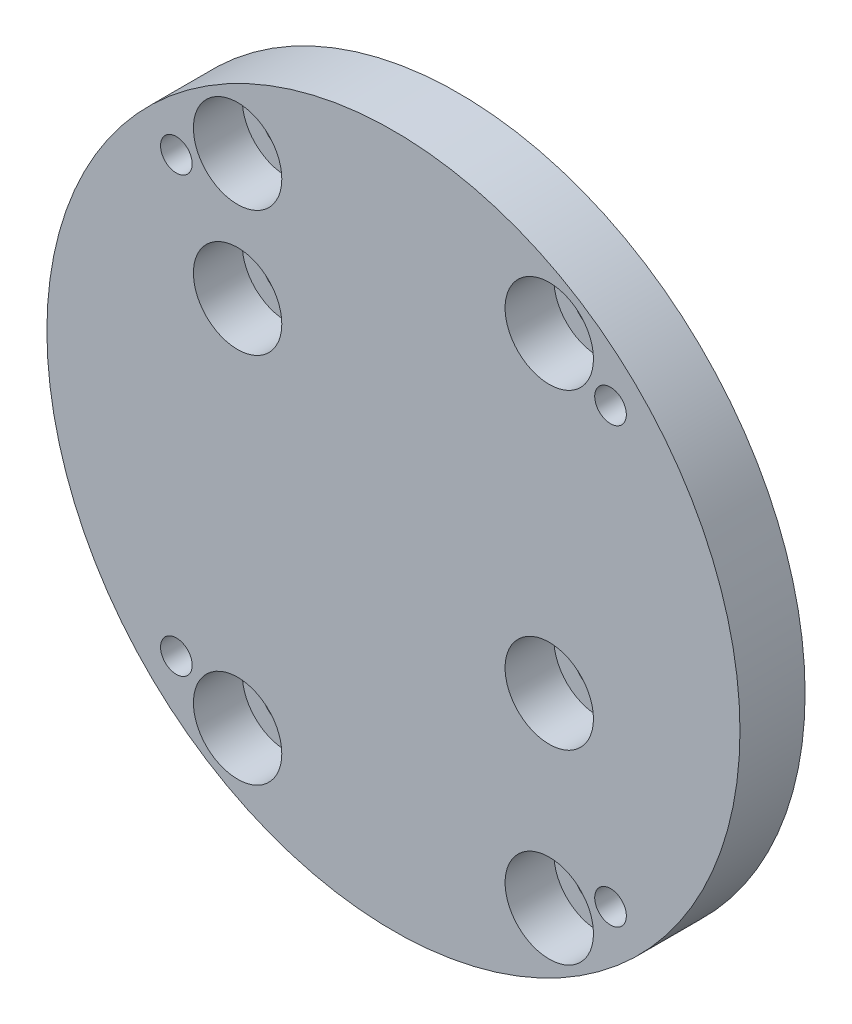
ISO-10303-21;
HEADER;
FILE_DESCRIPTION(('STEP AP214'),'2;1');
FILE_NAME('part.step','',(''),(''),'','','');
FILE_SCHEMA(('AUTOMOTIVE_DESIGN { 1 0 10303 214 1 1 1 1 }'));
ENDSEC;
DATA;
#1=APPLICATION_CONTEXT('core data for automotive mechanical design processes');
#2=APPLICATION_PROTOCOL_DEFINITION('international standard','automotive_design',2000,#1);
#3=PRODUCT_CONTEXT('',#1,'mechanical');
#4=PRODUCT('Part','Part','',(#3));
#5=PRODUCT_RELATED_PRODUCT_CATEGORY('part','',(#4));
#6=PRODUCT_DEFINITION_FORMATION('','',#4);
#7=PRODUCT_DEFINITION_CONTEXT('part definition',#1,'design');
#8=PRODUCT_DEFINITION('design','',#6,#7);
#9=PRODUCT_DEFINITION_SHAPE('','',#8);
#10=(LENGTH_UNIT() NAMED_UNIT(*) SI_UNIT(.MILLI.,.METRE.));
#11=(NAMED_UNIT(*) PLANE_ANGLE_UNIT() SI_UNIT($,.RADIAN.));
#12=(NAMED_UNIT(*) SI_UNIT($,.STERADIAN.) SOLID_ANGLE_UNIT());
#13=UNCERTAINTY_MEASURE_WITH_UNIT(LENGTH_MEASURE(1.E-05),#10,'distance_accuracy_value','');
#14=(GEOMETRIC_REPRESENTATION_CONTEXT(3) GLOBAL_UNCERTAINTY_ASSIGNED_CONTEXT((#13)) GLOBAL_UNIT_ASSIGNED_CONTEXT((#10,
#11,#12)) REPRESENTATION_CONTEXT('',''));
#15=CARTESIAN_POINT('',(0.,0.,0.));
#16=DIRECTION('',(0.,0.,1.));
#17=DIRECTION('',(1.,0.,0.));
#18=AXIS2_PLACEMENT_3D('',#15,#16,#17);
#19=CARTESIAN_POINT('',(0.,0.,14.));
#20=DIRECTION('',(0.,0.,-1.));
#21=DIRECTION('',(-1.,0.,0.));
#22=AXIS2_PLACEMENT_3D('',#19,#20,#21);
#23=CYLINDRICAL_SURFACE('',#22,74.5);
#24=CARTESIAN_POINT('',(0.,0.,14.));
#25=DIRECTION('',(0.,0.,1.));
#26=DIRECTION('',(1.,0.,0.));
#27=AXIS2_PLACEMENT_3D('',#24,#25,#26);
#28=CIRCLE('',#27,74.5);
#29=CARTESIAN_POINT('',(74.5,0.,14.));
#30=VERTEX_POINT('',#29);
#31=EDGE_CURVE('E10',#30,#30,#28,.T.);
#32=ORIENTED_EDGE('',*,*,#31,.F.);
#33=EDGE_LOOP('',(#32));
#34=FACE_BOUND('',#33,.T.);
#35=CARTESIAN_POINT('',(0.,0.,0.));
#36=DIRECTION('',(0.,0.,1.));
#37=DIRECTION('',(1.,0.,0.));
#38=AXIS2_PLACEMENT_3D('',#35,#36,#37);
#39=CIRCLE('',#38,74.5);
#40=CARTESIAN_POINT('',(74.5,0.,0.));
#41=VERTEX_POINT('',#40);
#42=EDGE_CURVE('E35',#41,#41,#39,.T.);
#43=ORIENTED_EDGE('',*,*,#42,.T.);
#44=EDGE_LOOP('',(#43));
#45=FACE_BOUND('',#44,.T.);
#46=ADVANCED_FACE('F32',(#34,#45),#23,.T.);
#47=CARTESIAN_POINT('',(0.,0.,14.));
#48=DIRECTION('',(0.,0.,1.));
#49=DIRECTION('',(1.,0.,0.));
#50=AXIS2_PLACEMENT_3D('',#47,#48,#49);
#51=PLANE('',#50);
#52=CARTESIAN_POINT('',(-46.6690475583116,46.6690475583127,14.));
#53=DIRECTION('',(0.,0.,1.));
#54=DIRECTION('',(1.,0.,0.));
#55=AXIS2_PLACEMENT_3D('',#52,#53,#54);
#56=CIRCLE('',#55,3.39999999999999);
#57=CARTESIAN_POINT('',(-43.2690475583116,46.6690475583127,14.));
#58=VERTEX_POINT('',#57);
#59=EDGE_CURVE('E136',#58,#58,#56,.T.);
#60=ORIENTED_EDGE('',*,*,#59,.F.);
#61=EDGE_LOOP('',(#60));
#62=FACE_BOUND('',#61,.T.);
#63=CARTESIAN_POINT('',(-46.6690475583122,-46.6690475583121,14.));
#64=DIRECTION('',(0.,0.,1.));
#65=DIRECTION('',(1.,0.,0.));
#66=AXIS2_PLACEMENT_3D('',#63,#64,#65);
#67=CIRCLE('',#66,3.39999999999999);
#68=CARTESIAN_POINT('',(-43.2690475583122,-46.6690475583121,14.));
#69=VERTEX_POINT('',#68);
#70=EDGE_CURVE('E130',#69,#69,#67,.T.);
#71=ORIENTED_EDGE('',*,*,#70,.F.);
#72=EDGE_LOOP('',(#71));
#73=FACE_BOUND('',#72,.T.);
#74=CARTESIAN_POINT('',(46.6690475583119,-46.6690475583124,14.));
#75=DIRECTION('',(0.,0.,1.));
#76=DIRECTION('',(1.,0.,0.));
#77=AXIS2_PLACEMENT_3D('',#74,#75,#76);
#78=CIRCLE('',#77,3.39999999999999);
#79=CARTESIAN_POINT('',(50.0690475583119,-46.6690475583124,14.));
#80=VERTEX_POINT('',#79);
#81=EDGE_CURVE('E124',#80,#80,#78,.T.);
#82=ORIENTED_EDGE('',*,*,#81,.F.);
#83=EDGE_LOOP('',(#82));
#84=FACE_BOUND('',#83,.T.);
#85=CARTESIAN_POINT('',(46.6690475583122,46.6690475583121,14.));
#86=DIRECTION('',(0.,0.,1.));
#87=DIRECTION('',(1.,0.,0.));
#88=AXIS2_PLACEMENT_3D('',#85,#86,#87);
#89=CIRCLE('',#88,3.39999999999999);
#90=CARTESIAN_POINT('',(50.0690475583122,46.6690475583121,14.));
#91=VERTEX_POINT('',#90);
#92=EDGE_CURVE('E118',#91,#91,#89,.T.);
#93=ORIENTED_EDGE('',*,*,#92,.F.);
#94=EDGE_LOOP('',(#93));
#95=FACE_BOUND('',#94,.T.);
#96=CARTESIAN_POINT('',(-33.5,26.5,14.));
#97=DIRECTION('',(0.,0.,1.));
#98=DIRECTION('',(1.,0.,0.));
#99=AXIS2_PLACEMENT_3D('',#96,#97,#98);
#100=CIRCLE('',#99,9.5);
#101=CARTESIAN_POINT('',(-24.,26.5,14.));
#102=VERTEX_POINT('',#101);
#103=EDGE_CURVE('E112',#102,#102,#100,.T.);
#104=ORIENTED_EDGE('',*,*,#103,.F.);
#105=EDGE_LOOP('',(#104));
#106=FACE_BOUND('',#105,.T.);
#107=CARTESIAN_POINT('',(-33.5,-53.5,14.));
#108=DIRECTION('',(0.,0.,1.));
#109=DIRECTION('',(1.,0.,0.));
#110=AXIS2_PLACEMENT_3D('',#107,#108,#109);
#111=CIRCLE('',#110,9.5);
#112=CARTESIAN_POINT('',(-24.,-53.5,14.));
#113=VERTEX_POINT('',#112);
#114=EDGE_CURVE('E100',#113,#113,#111,.T.);
#115=ORIENTED_EDGE('',*,*,#114,.F.);
#116=EDGE_LOOP('',(#115));
#117=FACE_BOUND('',#116,.T.);
#118=CARTESIAN_POINT('',(33.5,-53.5,14.));
#119=DIRECTION('',(0.,0.,1.));
#120=DIRECTION('',(1.,0.,0.));
#121=AXIS2_PLACEMENT_3D('',#118,#119,#120);
#122=CIRCLE('',#121,9.49999999999999);
#123=CARTESIAN_POINT('',(43.,-53.5,14.));
#124=VERTEX_POINT('',#123);
#125=EDGE_CURVE('E88',#124,#124,#122,.T.);
#126=ORIENTED_EDGE('',*,*,#125,.F.);
#127=EDGE_LOOP('',(#126));
#128=FACE_BOUND('',#127,.T.);
#129=CARTESIAN_POINT('',(33.5,-13.5,14.));
#130=DIRECTION('',(0.,0.,1.));
#131=DIRECTION('',(1.,0.,0.));
#132=AXIS2_PLACEMENT_3D('',#129,#130,#131);
#133=CIRCLE('',#132,9.49999999999999);
#134=CARTESIAN_POINT('',(43.,-13.5,14.));
#135=VERTEX_POINT('',#134);
#136=EDGE_CURVE('E76',#135,#135,#133,.T.);
#137=ORIENTED_EDGE('',*,*,#136,.F.);
#138=EDGE_LOOP('',(#137));
#139=FACE_BOUND('',#138,.T.);
#140=CARTESIAN_POINT('',(33.5,53.5,14.));
#141=DIRECTION('',(0.,0.,1.));
#142=DIRECTION('',(1.,0.,0.));
#143=AXIS2_PLACEMENT_3D('',#140,#141,#142);
#144=CIRCLE('',#143,9.49999999999999);
#145=CARTESIAN_POINT('',(43.,53.5,14.));
#146=VERTEX_POINT('',#145);
#147=EDGE_CURVE('E64',#146,#146,#144,.T.);
#148=ORIENTED_EDGE('',*,*,#147,.F.);
#149=EDGE_LOOP('',(#148));
#150=FACE_BOUND('',#149,.T.);
#151=CARTESIAN_POINT('',(-33.5,53.5,14.));
#152=DIRECTION('',(0.,0.,1.));
#153=DIRECTION('',(1.,0.,0.));
#154=AXIS2_PLACEMENT_3D('',#151,#152,#153);
#155=CIRCLE('',#154,9.5);
#156=CARTESIAN_POINT('',(-24.,53.5,14.));
#157=VERTEX_POINT('',#156);
#158=EDGE_CURVE('E52',#157,#157,#155,.T.);
#159=ORIENTED_EDGE('',*,*,#158,.F.);
#160=EDGE_LOOP('',(#159));
#161=FACE_BOUND('',#160,.T.);
#162=ORIENTED_EDGE('',*,*,#31,.T.);
#163=EDGE_LOOP('',(#162));
#164=FACE_BOUND('',#163,.T.);
#165=ADVANCED_FACE('F142',(#62,#73,#84,#95,#106,#117,#128,#139,#150,#161,#164),#51,.T.);
#166=CARTESIAN_POINT('',(0.,0.,0.));
#167=DIRECTION('',(0.,0.,1.));
#168=DIRECTION('',(1.,0.,0.));
#169=AXIS2_PLACEMENT_3D('',#166,#167,#168);
#170=PLANE('',#169);
#171=CARTESIAN_POINT('',(-46.6690475583116,46.6690475583127,0.));
#172=DIRECTION('',(0.,0.,1.));
#173=DIRECTION('',(1.,0.,0.));
#174=AXIS2_PLACEMENT_3D('',#171,#172,#173);
#175=CIRCLE('',#174,3.39999999999999);
#176=CARTESIAN_POINT('',(-43.2690475583116,46.6690475583127,0.));
#177=VERTEX_POINT('',#176);
#178=EDGE_CURVE('E133',#177,#177,#175,.T.);
#179=ORIENTED_EDGE('',*,*,#178,.T.);
#180=EDGE_LOOP('',(#179));
#181=FACE_BOUND('',#180,.T.);
#182=CARTESIAN_POINT('',(-46.6690475583122,-46.6690475583121,0.));
#183=DIRECTION('',(0.,0.,1.));
#184=DIRECTION('',(1.,0.,0.));
#185=AXIS2_PLACEMENT_3D('',#182,#183,#184);
#186=CIRCLE('',#185,3.39999999999999);
#187=CARTESIAN_POINT('',(-43.2690475583122,-46.6690475583121,0.));
#188=VERTEX_POINT('',#187);
#189=EDGE_CURVE('E127',#188,#188,#186,.T.);
#190=ORIENTED_EDGE('',*,*,#189,.T.);
#191=EDGE_LOOP('',(#190));
#192=FACE_BOUND('',#191,.T.);
#193=CARTESIAN_POINT('',(46.6690475583119,-46.6690475583124,0.));
#194=DIRECTION('',(0.,0.,1.));
#195=DIRECTION('',(1.,0.,0.));
#196=AXIS2_PLACEMENT_3D('',#193,#194,#195);
#197=CIRCLE('',#196,3.39999999999999);
#198=CARTESIAN_POINT('',(50.0690475583119,-46.6690475583124,0.));
#199=VERTEX_POINT('',#198);
#200=EDGE_CURVE('E121',#199,#199,#197,.T.);
#201=ORIENTED_EDGE('',*,*,#200,.T.);
#202=EDGE_LOOP('',(#201));
#203=FACE_BOUND('',#202,.T.);
#204=CARTESIAN_POINT('',(46.6690475583122,46.6690475583121,0.));
#205=DIRECTION('',(0.,0.,1.));
#206=DIRECTION('',(1.,0.,0.));
#207=AXIS2_PLACEMENT_3D('',#204,#205,#206);
#208=CIRCLE('',#207,3.39999999999999);
#209=CARTESIAN_POINT('',(50.0690475583122,46.6690475583121,0.));
#210=VERTEX_POINT('',#209);
#211=EDGE_CURVE('E115',#210,#210,#208,.T.);
#212=ORIENTED_EDGE('',*,*,#211,.T.);
#213=EDGE_LOOP('',(#212));
#214=FACE_BOUND('',#213,.T.);
#215=CARTESIAN_POINT('',(-33.5,26.5,0.));
#216=DIRECTION('',(0.,0.,1.));
#217=DIRECTION('',(1.,0.,0.));
#218=AXIS2_PLACEMENT_3D('',#215,#216,#217);
#219=CIRCLE('',#218,5.5);
#220=CARTESIAN_POINT('',(-28.,26.5,0.));
#221=VERTEX_POINT('',#220);
#222=EDGE_CURVE('E103',#221,#221,#219,.T.);
#223=ORIENTED_EDGE('',*,*,#222,.T.);
#224=EDGE_LOOP('',(#223));
#225=FACE_BOUND('',#224,.T.);
#226=CARTESIAN_POINT('',(-33.5,-53.5,0.));
#227=DIRECTION('',(0.,0.,1.));
#228=DIRECTION('',(1.,0.,0.));
#229=AXIS2_PLACEMENT_3D('',#226,#227,#228);
#230=CIRCLE('',#229,5.5);
#231=CARTESIAN_POINT('',(-28.,-53.5,0.));
#232=VERTEX_POINT('',#231);
#233=EDGE_CURVE('E91',#232,#232,#230,.T.);
#234=ORIENTED_EDGE('',*,*,#233,.T.);
#235=EDGE_LOOP('',(#234));
#236=FACE_BOUND('',#235,.T.);
#237=CARTESIAN_POINT('',(33.5,-53.5,0.));
#238=DIRECTION('',(0.,0.,1.));
#239=DIRECTION('',(1.,0.,0.));
#240=AXIS2_PLACEMENT_3D('',#237,#238,#239);
#241=CIRCLE('',#240,5.5);
#242=CARTESIAN_POINT('',(39.,-53.5,0.));
#243=VERTEX_POINT('',#242);
#244=EDGE_CURVE('E79',#243,#243,#241,.T.);
#245=ORIENTED_EDGE('',*,*,#244,.T.);
#246=EDGE_LOOP('',(#245));
#247=FACE_BOUND('',#246,.T.);
#248=CARTESIAN_POINT('',(33.5,-13.5,0.));
#249=DIRECTION('',(0.,0.,1.));
#250=DIRECTION('',(1.,0.,0.));
#251=AXIS2_PLACEMENT_3D('',#248,#249,#250);
#252=CIRCLE('',#251,5.5);
#253=CARTESIAN_POINT('',(39.,-13.5,0.));
#254=VERTEX_POINT('',#253);
#255=EDGE_CURVE('E67',#254,#254,#252,.T.);
#256=ORIENTED_EDGE('',*,*,#255,.T.);
#257=EDGE_LOOP('',(#256));
#258=FACE_BOUND('',#257,.T.);
#259=CARTESIAN_POINT('',(33.5,53.5,0.));
#260=DIRECTION('',(0.,0.,1.));
#261=DIRECTION('',(1.,0.,0.));
#262=AXIS2_PLACEMENT_3D('',#259,#260,#261);
#263=CIRCLE('',#262,5.5);
#264=CARTESIAN_POINT('',(39.,53.5,0.));
#265=VERTEX_POINT('',#264);
#266=EDGE_CURVE('E55',#265,#265,#263,.T.);
#267=ORIENTED_EDGE('',*,*,#266,.T.);
#268=EDGE_LOOP('',(#267));
#269=FACE_BOUND('',#268,.T.);
#270=CARTESIAN_POINT('',(-33.5,53.5,0.));
#271=DIRECTION('',(0.,0.,1.));
#272=DIRECTION('',(1.,0.,0.));
#273=AXIS2_PLACEMENT_3D('',#270,#271,#272);
#274=CIRCLE('',#273,5.5);
#275=CARTESIAN_POINT('',(-28.,53.5,0.));
#276=VERTEX_POINT('',#275);
#277=EDGE_CURVE('E42',#276,#276,#274,.T.);
#278=ORIENTED_EDGE('',*,*,#277,.T.);
#279=EDGE_LOOP('',(#278));
#280=FACE_BOUND('',#279,.T.);
#281=ORIENTED_EDGE('',*,*,#42,.F.);
#282=EDGE_LOOP('',(#281));
#283=FACE_BOUND('',#282,.T.);
#284=ADVANCED_FACE('F145',(#181,#192,#203,#214,#225,#236,#247,#258,#269,#280,#283),#170,.F.);
#285=CARTESIAN_POINT('',(-33.5,53.5,14.));
#286=DIRECTION('',(0.,0.,1.));
#287=DIRECTION('',(1.,0.,0.));
#288=AXIS2_PLACEMENT_3D('',#285,#286,#287);
#289=CYLINDRICAL_SURFACE('',#288,5.5);
#290=ORIENTED_EDGE('',*,*,#277,.F.);
#291=EDGE_LOOP('',(#290));
#292=FACE_BOUND('',#291,.T.);
#293=CARTESIAN_POINT('',(-33.5,53.5,3.5));
#294=DIRECTION('',(0.,0.,1.));
#295=DIRECTION('',(1.,0.,0.));
#296=AXIS2_PLACEMENT_3D('',#293,#294,#295);
#297=CIRCLE('',#296,5.5);
#298=CARTESIAN_POINT('',(-28.,53.5,3.5));
#299=VERTEX_POINT('',#298);
#300=EDGE_CURVE('E46',#299,#299,#297,.T.);
#301=ORIENTED_EDGE('',*,*,#300,.T.);
#302=EDGE_LOOP('',(#301));
#303=FACE_BOUND('',#302,.T.);
#304=ADVANCED_FACE('F178',(#292,#303),#289,.F.);
#305=CARTESIAN_POINT('',(-28.,53.5,3.5));
#306=DIRECTION('',(0.,0.,-1.));
#307=DIRECTION('',(-1.,0.,0.));
#308=AXIS2_PLACEMENT_3D('',#305,#306,#307);
#309=PLANE('',#308);
#310=ORIENTED_EDGE('',*,*,#300,.F.);
#311=EDGE_LOOP('',(#310));
#312=FACE_BOUND('',#311,.T.);
#313=CARTESIAN_POINT('',(-33.5,53.5,3.5));
#314=DIRECTION('',(0.,0.,1.));
#315=DIRECTION('',(1.,0.,0.));
#316=AXIS2_PLACEMENT_3D('',#313,#314,#315);
#317=CIRCLE('',#316,9.49999999999999);
#318=CARTESIAN_POINT('',(-24.,53.5,3.5));
#319=VERTEX_POINT('',#318);
#320=EDGE_CURVE('E49',#319,#319,#317,.T.);
#321=ORIENTED_EDGE('',*,*,#320,.T.);
#322=EDGE_LOOP('',(#321));
#323=FACE_BOUND('',#322,.T.);
#324=ADVANCED_FACE('F168',(#312,#323),#309,.F.);
#325=CARTESIAN_POINT('',(-33.5,53.5,14.));
#326=DIRECTION('',(0.,0.,1.));
#327=DIRECTION('',(1.,0.,0.));
#328=AXIS2_PLACEMENT_3D('',#325,#326,#327);
#329=CYLINDRICAL_SURFACE('',#328,9.5);
#330=ORIENTED_EDGE('',*,*,#320,.F.);
#331=EDGE_LOOP('',(#330));
#332=FACE_BOUND('',#331,.T.);
#333=ORIENTED_EDGE('',*,*,#158,.T.);
#334=EDGE_LOOP('',(#333));
#335=FACE_BOUND('',#334,.T.);
#336=ADVANCED_FACE('F165',(#332,#335),#329,.F.);
#337=CARTESIAN_POINT('',(33.5,53.5,14.));
#338=DIRECTION('',(0.,0.,1.));
#339=DIRECTION('',(1.,0.,0.));
#340=AXIS2_PLACEMENT_3D('',#337,#338,#339);
#341=CYLINDRICAL_SURFACE('',#340,5.5);
#342=ORIENTED_EDGE('',*,*,#266,.F.);
#343=EDGE_LOOP('',(#342));
#344=FACE_BOUND('',#343,.T.);
#345=CARTESIAN_POINT('',(33.5,53.5,3.5));
#346=DIRECTION('',(0.,0.,1.));
#347=DIRECTION('',(1.,0.,0.));
#348=AXIS2_PLACEMENT_3D('',#345,#346,#347);
#349=CIRCLE('',#348,5.5);
#350=CARTESIAN_POINT('',(39.,53.5,3.5));
#351=VERTEX_POINT('',#350);
#352=EDGE_CURVE('E58',#351,#351,#349,.T.);
#353=ORIENTED_EDGE('',*,*,#352,.T.);
#354=EDGE_LOOP('',(#353));
#355=FACE_BOUND('',#354,.T.);
#356=ADVANCED_FACE('F167',(#344,#355),#341,.F.);
#357=CARTESIAN_POINT('',(39.,53.5,3.5));
#358=DIRECTION('',(0.,0.,-1.));
#359=DIRECTION('',(-1.,0.,0.));
#360=AXIS2_PLACEMENT_3D('',#357,#358,#359);
#361=PLANE('',#360);
#362=ORIENTED_EDGE('',*,*,#352,.F.);
#363=EDGE_LOOP('',(#362));
#364=FACE_BOUND('',#363,.T.);
#365=CARTESIAN_POINT('',(33.5,53.5,3.5));
#366=DIRECTION('',(0.,0.,1.));
#367=DIRECTION('',(1.,0.,0.));
#368=AXIS2_PLACEMENT_3D('',#365,#366,#367);
#369=CIRCLE('',#368,9.49999999999999);
#370=CARTESIAN_POINT('',(43.,53.5,3.5));
#371=VERTEX_POINT('',#370);
#372=EDGE_CURVE('E61',#371,#371,#369,.T.);
#373=ORIENTED_EDGE('',*,*,#372,.T.);
#374=EDGE_LOOP('',(#373));
#375=FACE_BOUND('',#374,.T.);
#376=ADVANCED_FACE('F175',(#364,#375),#361,.F.);
#377=CARTESIAN_POINT('',(33.5,53.5,14.));
#378=DIRECTION('',(0.,0.,1.));
#379=DIRECTION('',(1.,0.,0.));
#380=AXIS2_PLACEMENT_3D('',#377,#378,#379);
#381=CYLINDRICAL_SURFACE('',#380,9.49999999999999);
#382=ORIENTED_EDGE('',*,*,#372,.F.);
#383=EDGE_LOOP('',(#382));
#384=FACE_BOUND('',#383,.T.);
#385=ORIENTED_EDGE('',*,*,#147,.T.);
#386=EDGE_LOOP('',(#385));
#387=FACE_BOUND('',#386,.T.);
#388=ADVANCED_FACE('F223',(#384,#387),#381,.F.);
#389=CARTESIAN_POINT('',(33.5,-13.5,14.));
#390=DIRECTION('',(0.,0.,1.));
#391=DIRECTION('',(1.,0.,0.));
#392=AXIS2_PLACEMENT_3D('',#389,#390,#391);
#393=CYLINDRICAL_SURFACE('',#392,5.5);
#394=ORIENTED_EDGE('',*,*,#255,.F.);
#395=EDGE_LOOP('',(#394));
#396=FACE_BOUND('',#395,.T.);
#397=CARTESIAN_POINT('',(33.5,-13.5,3.5));
#398=DIRECTION('',(0.,0.,1.));
#399=DIRECTION('',(1.,0.,0.));
#400=AXIS2_PLACEMENT_3D('',#397,#398,#399);
#401=CIRCLE('',#400,5.5);
#402=CARTESIAN_POINT('',(39.,-13.5,3.5));
#403=VERTEX_POINT('',#402);
#404=EDGE_CURVE('E70',#403,#403,#401,.T.);
#405=ORIENTED_EDGE('',*,*,#404,.T.);
#406=EDGE_LOOP('',(#405));
#407=FACE_BOUND('',#406,.T.);
#408=ADVANCED_FACE('F229',(#396,#407),#393,.F.);
#409=CARTESIAN_POINT('',(39.,-13.5,3.5));
#410=DIRECTION('',(0.,0.,-1.));
#411=DIRECTION('',(-1.,0.,0.));
#412=AXIS2_PLACEMENT_3D('',#409,#410,#411);
#413=PLANE('',#412);
#414=ORIENTED_EDGE('',*,*,#404,.F.);
#415=EDGE_LOOP('',(#414));
#416=FACE_BOUND('',#415,.T.);
#417=CARTESIAN_POINT('',(33.5,-13.5,3.5));
#418=DIRECTION('',(0.,0.,1.));
#419=DIRECTION('',(1.,0.,0.));
#420=AXIS2_PLACEMENT_3D('',#417,#418,#419);
#421=CIRCLE('',#420,9.49999999999999);
#422=CARTESIAN_POINT('',(43.,-13.5,3.5));
#423=VERTEX_POINT('',#422);
#424=EDGE_CURVE('E73',#423,#423,#421,.T.);
#425=ORIENTED_EDGE('',*,*,#424,.T.);
#426=EDGE_LOOP('',(#425));
#427=FACE_BOUND('',#426,.T.);
#428=ADVANCED_FACE('F234',(#416,#427),#413,.F.);
#429=CARTESIAN_POINT('',(33.5,-13.5,14.));
#430=DIRECTION('',(0.,0.,1.));
#431=DIRECTION('',(1.,0.,0.));
#432=AXIS2_PLACEMENT_3D('',#429,#430,#431);
#433=CYLINDRICAL_SURFACE('',#432,9.49999999999999);
#434=ORIENTED_EDGE('',*,*,#424,.F.);
#435=EDGE_LOOP('',(#434));
#436=FACE_BOUND('',#435,.T.);
#437=ORIENTED_EDGE('',*,*,#136,.T.);
#438=EDGE_LOOP('',(#437));
#439=FACE_BOUND('',#438,.T.);
#440=ADVANCED_FACE('F240',(#436,#439),#433,.F.);
#441=CARTESIAN_POINT('',(33.5,-53.5,14.));
#442=DIRECTION('',(0.,0.,1.));
#443=DIRECTION('',(1.,0.,0.));
#444=AXIS2_PLACEMENT_3D('',#441,#442,#443);
#445=CYLINDRICAL_SURFACE('',#444,5.5);
#446=ORIENTED_EDGE('',*,*,#244,.F.);
#447=EDGE_LOOP('',(#446));
#448=FACE_BOUND('',#447,.T.);
#449=CARTESIAN_POINT('',(33.5,-53.5,3.5));
#450=DIRECTION('',(0.,0.,1.));
#451=DIRECTION('',(1.,0.,0.));
#452=AXIS2_PLACEMENT_3D('',#449,#450,#451);
#453=CIRCLE('',#452,5.5);
#454=CARTESIAN_POINT('',(39.,-53.5,3.5));
#455=VERTEX_POINT('',#454);
#456=EDGE_CURVE('E82',#455,#455,#453,.T.);
#457=ORIENTED_EDGE('',*,*,#456,.T.);
#458=EDGE_LOOP('',(#457));
#459=FACE_BOUND('',#458,.T.);
#460=ADVANCED_FACE('F244',(#448,#459),#445,.F.);
#461=CARTESIAN_POINT('',(39.,-53.5,3.5));
#462=DIRECTION('',(0.,0.,-1.));
#463=DIRECTION('',(-1.,0.,0.));
#464=AXIS2_PLACEMENT_3D('',#461,#462,#463);
#465=PLANE('',#464);
#466=ORIENTED_EDGE('',*,*,#456,.F.);
#467=EDGE_LOOP('',(#466));
#468=FACE_BOUND('',#467,.T.);
#469=CARTESIAN_POINT('',(33.5,-53.5,3.5));
#470=DIRECTION('',(0.,0.,1.));
#471=DIRECTION('',(1.,0.,0.));
#472=AXIS2_PLACEMENT_3D('',#469,#470,#471);
#473=CIRCLE('',#472,9.49999999999999);
#474=CARTESIAN_POINT('',(43.,-53.5,3.5));
#475=VERTEX_POINT('',#474);
#476=EDGE_CURVE('E85',#475,#475,#473,.T.);
#477=ORIENTED_EDGE('',*,*,#476,.T.);
#478=EDGE_LOOP('',(#477));
#479=FACE_BOUND('',#478,.T.);
#480=ADVANCED_FACE('F248',(#468,#479),#465,.F.);
#481=CARTESIAN_POINT('',(33.5,-53.5,14.));
#482=DIRECTION('',(0.,0.,1.));
#483=DIRECTION('',(1.,0.,0.));
#484=AXIS2_PLACEMENT_3D('',#481,#482,#483);
#485=CYLINDRICAL_SURFACE('',#484,9.49999999999999);
#486=ORIENTED_EDGE('',*,*,#476,.F.);
#487=EDGE_LOOP('',(#486));
#488=FACE_BOUND('',#487,.T.);
#489=ORIENTED_EDGE('',*,*,#125,.T.);
#490=EDGE_LOOP('',(#489));
#491=FACE_BOUND('',#490,.T.);
#492=ADVANCED_FACE('F252',(#488,#491),#485,.F.);
#493=CARTESIAN_POINT('',(-33.5,-53.5,14.));
#494=DIRECTION('',(0.,0.,1.));
#495=DIRECTION('',(1.,0.,0.));
#496=AXIS2_PLACEMENT_3D('',#493,#494,#495);
#497=CYLINDRICAL_SURFACE('',#496,5.5);
#498=ORIENTED_EDGE('',*,*,#233,.F.);
#499=EDGE_LOOP('',(#498));
#500=FACE_BOUND('',#499,.T.);
#501=CARTESIAN_POINT('',(-33.5,-53.5,3.5));
#502=DIRECTION('',(0.,0.,1.));
#503=DIRECTION('',(1.,0.,0.));
#504=AXIS2_PLACEMENT_3D('',#501,#502,#503);
#505=CIRCLE('',#504,5.5);
#506=CARTESIAN_POINT('',(-28.,-53.5,3.5));
#507=VERTEX_POINT('',#506);
#508=EDGE_CURVE('E94',#507,#507,#505,.T.);
#509=ORIENTED_EDGE('',*,*,#508,.T.);
#510=EDGE_LOOP('',(#509));
#511=FACE_BOUND('',#510,.T.);
#512=ADVANCED_FACE('F256',(#500,#511),#497,.F.);
#513=CARTESIAN_POINT('',(-28.,-53.5,3.5));
#514=DIRECTION('',(0.,0.,-1.));
#515=DIRECTION('',(-1.,0.,0.));
#516=AXIS2_PLACEMENT_3D('',#513,#514,#515);
#517=PLANE('',#516);
#518=ORIENTED_EDGE('',*,*,#508,.F.);
#519=EDGE_LOOP('',(#518));
#520=FACE_BOUND('',#519,.T.);
#521=CARTESIAN_POINT('',(-33.5,-53.5,3.5));
#522=DIRECTION('',(0.,0.,1.));
#523=DIRECTION('',(1.,0.,0.));
#524=AXIS2_PLACEMENT_3D('',#521,#522,#523);
#525=CIRCLE('',#524,9.49999999999999);
#526=CARTESIAN_POINT('',(-24.,-53.5,3.5));
#527=VERTEX_POINT('',#526);
#528=EDGE_CURVE('E97',#527,#527,#525,.T.);
#529=ORIENTED_EDGE('',*,*,#528,.T.);
#530=EDGE_LOOP('',(#529));
#531=FACE_BOUND('',#530,.T.);
#532=ADVANCED_FACE('F260',(#520,#531),#517,.F.);
#533=CARTESIAN_POINT('',(-33.5,-53.5,14.));
#534=DIRECTION('',(0.,0.,1.));
#535=DIRECTION('',(1.,0.,0.));
#536=AXIS2_PLACEMENT_3D('',#533,#534,#535);
#537=CYLINDRICAL_SURFACE('',#536,9.5);
#538=ORIENTED_EDGE('',*,*,#528,.F.);
#539=EDGE_LOOP('',(#538));
#540=FACE_BOUND('',#539,.T.);
#541=ORIENTED_EDGE('',*,*,#114,.T.);
#542=EDGE_LOOP('',(#541));
#543=FACE_BOUND('',#542,.T.);
#544=ADVANCED_FACE('F264',(#540,#543),#537,.F.);
#545=CARTESIAN_POINT('',(-33.5,26.5,14.));
#546=DIRECTION('',(0.,0.,1.));
#547=DIRECTION('',(1.,0.,0.));
#548=AXIS2_PLACEMENT_3D('',#545,#546,#547);
#549=CYLINDRICAL_SURFACE('',#548,5.5);
#550=ORIENTED_EDGE('',*,*,#222,.F.);
#551=EDGE_LOOP('',(#550));
#552=FACE_BOUND('',#551,.T.);
#553=CARTESIAN_POINT('',(-33.5,26.5,3.5));
#554=DIRECTION('',(0.,0.,1.));
#555=DIRECTION('',(1.,0.,0.));
#556=AXIS2_PLACEMENT_3D('',#553,#554,#555);
#557=CIRCLE('',#556,5.5);
#558=CARTESIAN_POINT('',(-28.,26.5,3.5));
#559=VERTEX_POINT('',#558);
#560=EDGE_CURVE('E106',#559,#559,#557,.T.);
#561=ORIENTED_EDGE('',*,*,#560,.T.);
#562=EDGE_LOOP('',(#561));
#563=FACE_BOUND('',#562,.T.);
#564=ADVANCED_FACE('F268',(#552,#563),#549,.F.);
#565=CARTESIAN_POINT('',(-28.,26.5,3.5));
#566=DIRECTION('',(0.,0.,-1.));
#567=DIRECTION('',(-1.,0.,0.));
#568=AXIS2_PLACEMENT_3D('',#565,#566,#567);
#569=PLANE('',#568);
#570=ORIENTED_EDGE('',*,*,#560,.F.);
#571=EDGE_LOOP('',(#570));
#572=FACE_BOUND('',#571,.T.);
#573=CARTESIAN_POINT('',(-33.5,26.5,3.5));
#574=DIRECTION('',(0.,0.,1.));
#575=DIRECTION('',(1.,0.,0.));
#576=AXIS2_PLACEMENT_3D('',#573,#574,#575);
#577=CIRCLE('',#576,9.49999999999999);
#578=CARTESIAN_POINT('',(-24.,26.5,3.5));
#579=VERTEX_POINT('',#578);
#580=EDGE_CURVE('E109',#579,#579,#577,.T.);
#581=ORIENTED_EDGE('',*,*,#580,.T.);
#582=EDGE_LOOP('',(#581));
#583=FACE_BOUND('',#582,.T.);
#584=ADVANCED_FACE('F272',(#572,#583),#569,.F.);
#585=CARTESIAN_POINT('',(-33.5,26.5,14.));
#586=DIRECTION('',(0.,0.,1.));
#587=DIRECTION('',(1.,0.,0.));
#588=AXIS2_PLACEMENT_3D('',#585,#586,#587);
#589=CYLINDRICAL_SURFACE('',#588,9.5);
#590=ORIENTED_EDGE('',*,*,#580,.F.);
#591=EDGE_LOOP('',(#590));
#592=FACE_BOUND('',#591,.T.);
#593=ORIENTED_EDGE('',*,*,#103,.T.);
#594=EDGE_LOOP('',(#593));
#595=FACE_BOUND('',#594,.T.);
#596=ADVANCED_FACE('F276',(#592,#595),#589,.F.);
#597=CARTESIAN_POINT('',(46.6690475583122,46.6690475583121,14.));
#598=DIRECTION('',(0.,0.,1.));
#599=DIRECTION('',(1.,0.,0.));
#600=AXIS2_PLACEMENT_3D('',#597,#598,#599);
#601=CYLINDRICAL_SURFACE('',#600,3.39999999999999);
#602=ORIENTED_EDGE('',*,*,#211,.F.);
#603=EDGE_LOOP('',(#602));
#604=FACE_BOUND('',#603,.T.);
#605=ORIENTED_EDGE('',*,*,#92,.T.);
#606=EDGE_LOOP('',(#605));
#607=FACE_BOUND('',#606,.T.);
#608=ADVANCED_FACE('F280',(#604,#607),#601,.F.);
#609=CARTESIAN_POINT('',(46.6690475583119,-46.6690475583124,14.));
#610=DIRECTION('',(0.,0.,1.));
#611=DIRECTION('',(1.,0.,0.));
#612=AXIS2_PLACEMENT_3D('',#609,#610,#611);
#613=CYLINDRICAL_SURFACE('',#612,3.39999999999999);
#614=ORIENTED_EDGE('',*,*,#200,.F.);
#615=EDGE_LOOP('',(#614));
#616=FACE_BOUND('',#615,.T.);
#617=ORIENTED_EDGE('',*,*,#81,.T.);
#618=EDGE_LOOP('',(#617));
#619=FACE_BOUND('',#618,.T.);
#620=ADVANCED_FACE('F284',(#616,#619),#613,.F.);
#621=CARTESIAN_POINT('',(-46.6690475583122,-46.6690475583121,14.));
#622=DIRECTION('',(0.,0.,1.));
#623=DIRECTION('',(1.,0.,0.));
#624=AXIS2_PLACEMENT_3D('',#621,#622,#623);
#625=CYLINDRICAL_SURFACE('',#624,3.39999999999999);
#626=ORIENTED_EDGE('',*,*,#189,.F.);
#627=EDGE_LOOP('',(#626));
#628=FACE_BOUND('',#627,.T.);
#629=ORIENTED_EDGE('',*,*,#70,.T.);
#630=EDGE_LOOP('',(#629));
#631=FACE_BOUND('',#630,.T.);
#632=ADVANCED_FACE('F288',(#628,#631),#625,.F.);
#633=CARTESIAN_POINT('',(-46.6690475583116,46.6690475583127,14.));
#634=DIRECTION('',(0.,0.,1.));
#635=DIRECTION('',(1.,0.,0.));
#636=AXIS2_PLACEMENT_3D('',#633,#634,#635);
#637=CYLINDRICAL_SURFACE('',#636,3.39999999999999);
#638=ORIENTED_EDGE('',*,*,#178,.F.);
#639=EDGE_LOOP('',(#638));
#640=FACE_BOUND('',#639,.T.);
#641=ORIENTED_EDGE('',*,*,#59,.T.);
#642=EDGE_LOOP('',(#641));
#643=FACE_BOUND('',#642,.T.);
#644=ADVANCED_FACE('F140',(#640,#643),#637,.F.);
#645=CLOSED_SHELL('',(#46,#165,#284,#304,#324,#336,#356,#376,#388,#408,#428,#440,#460,#480,#492,
#512,#532,#544,#564,#584,#596,#608,#620,#632,#644));
#646=MANIFOLD_SOLID_BREP('B2',#645);
#647=ADVANCED_BREP_SHAPE_REPRESENTATION('',(#18,#646),#14);
#648=SHAPE_DEFINITION_REPRESENTATION(#9,#647);
ENDSEC;
END-ISO-10303-21;
